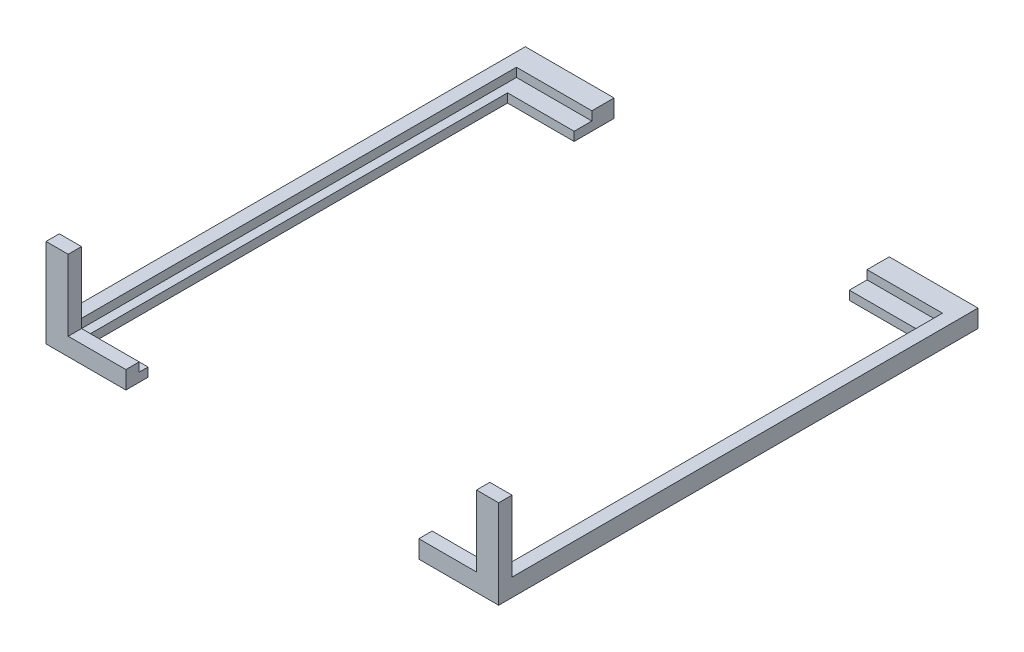
ISO-10303-21;
HEADER;
FILE_DESCRIPTION(('STEP AP214'),'2;1');
FILE_NAME('part.step','',(''),(''),'','','');
FILE_SCHEMA(('AUTOMOTIVE_DESIGN { 1 0 10303 214 1 1 1 1 }'));
ENDSEC;
DATA;
#1=APPLICATION_CONTEXT('core data for automotive mechanical design processes');
#2=APPLICATION_PROTOCOL_DEFINITION('international standard','automotive_design',2000,#1);
#3=PRODUCT_CONTEXT('',#1,'mechanical');
#4=PRODUCT('Part','Part','',(#3));
#5=PRODUCT_RELATED_PRODUCT_CATEGORY('part','',(#4));
#6=PRODUCT_DEFINITION_FORMATION('','',#4);
#7=PRODUCT_DEFINITION_CONTEXT('part definition',#1,'design');
#8=PRODUCT_DEFINITION('design','',#6,#7);
#9=PRODUCT_DEFINITION_SHAPE('','',#8);
#10=(LENGTH_UNIT() NAMED_UNIT(*) SI_UNIT(.MILLI.,.METRE.));
#11=(NAMED_UNIT(*) PLANE_ANGLE_UNIT() SI_UNIT($,.RADIAN.));
#12=(NAMED_UNIT(*) SI_UNIT($,.STERADIAN.) SOLID_ANGLE_UNIT());
#13=UNCERTAINTY_MEASURE_WITH_UNIT(LENGTH_MEASURE(1.E-05),#10,'distance_accuracy_value','');
#14=(GEOMETRIC_REPRESENTATION_CONTEXT(3) GLOBAL_UNCERTAINTY_ASSIGNED_CONTEXT((#13)) GLOBAL_UNIT_ASSIGNED_CONTEXT((#10,
#11,#12)) REPRESENTATION_CONTEXT('',''));
#15=CARTESIAN_POINT('',(0.,0.,0.));
#16=DIRECTION('',(0.,0.,1.));
#17=DIRECTION('',(1.,0.,0.));
#18=AXIS2_PLACEMENT_3D('',#15,#16,#17);
#19=CARTESIAN_POINT('',(23.,0.,24.5));
#20=DIRECTION('',(0.,0.,1.));
#21=DIRECTION('',(1.,0.,0.));
#22=AXIS2_PLACEMENT_3D('',#19,#20,#21);
#23=PLANE('',#22);
#24=DIRECTION('',(-1.,0.,0.));
#25=VECTOR('',#24,1.);
#26=CARTESIAN_POINT('',(23.,1.,24.5));
#27=LINE('',#26,#25);
#28=CARTESIAN_POINT('',(-16.5,1.,24.5));
#29=VERTEX_POINT('',#28);
#30=CARTESIAN_POINT('',(-23.,1.,24.5));
#31=VERTEX_POINT('',#30);
#32=EDGE_CURVE('E251',#29,#31,#27,.T.);
#33=ORIENTED_EDGE('',*,*,#32,.F.);
#34=DIRECTION('',(0.,1.,0.));
#35=VECTOR('',#34,1.);
#36=CARTESIAN_POINT('',(-16.5,0.,24.5));
#37=LINE('',#36,#35);
#38=CARTESIAN_POINT('',(-16.5,0.,24.5));
#39=VERTEX_POINT('',#38);
#40=EDGE_CURVE('E80',#39,#29,#37,.T.);
#41=ORIENTED_EDGE('',*,*,#40,.F.);
#42=DIRECTION('',(1.,0.,0.));
#43=VECTOR('',#42,1.);
#44=CARTESIAN_POINT('',(23.,0.,24.5));
#45=LINE('',#44,#43);
#46=CARTESIAN_POINT('',(-23.,0.,24.5));
#47=VERTEX_POINT('',#46);
#48=EDGE_CURVE('E250',#47,#39,#45,.T.);
#49=ORIENTED_EDGE('',*,*,#48,.F.);
#50=DIRECTION('',(0.,1.,0.));
#51=VECTOR('',#50,1.);
#52=CARTESIAN_POINT('',(-23.,0.,24.5));
#53=LINE('',#52,#51);
#54=EDGE_CURVE('E267',#47,#31,#53,.T.);
#55=ORIENTED_EDGE('',*,*,#54,.T.);
#56=EDGE_LOOP('',(#33,#41,#49,#55));
#57=FACE_BOUND('',#56,.T.);
#58=ADVANCED_FACE('F51',(#57),#23,.F.);
#59=CARTESIAN_POINT('',(25.5,10.,27.));
#60=DIRECTION('',(0.,0.,-1.));
#61=DIRECTION('',(-1.,0.,0.));
#62=AXIS2_PLACEMENT_3D('',#59,#60,#61);
#63=PLANE('',#62);
#64=DIRECTION('',(1.,0.,0.));
#65=VECTOR('',#64,1.);
#66=CARTESIAN_POINT('',(25.5,0.,27.));
#67=LINE('',#66,#65);
#68=CARTESIAN_POINT('',(-25.5,0.,27.));
#69=VERTEX_POINT('',#68);
#70=CARTESIAN_POINT('',(-16.5,0.,27.));
#71=VERTEX_POINT('',#70);
#72=EDGE_CURVE('E243',#69,#71,#67,.T.);
#73=ORIENTED_EDGE('',*,*,#72,.T.);
#74=DIRECTION('',(0.,1.,0.));
#75=VECTOR('',#74,1.);
#76=CARTESIAN_POINT('',(-16.5,10.,27.));
#77=LINE('',#76,#75);
#78=CARTESIAN_POINT('',(-16.5,2.,27.));
#79=VERTEX_POINT('',#78);
#80=EDGE_CURVE('E69',#71,#79,#77,.T.);
#81=ORIENTED_EDGE('',*,*,#80,.T.);
#82=DIRECTION('',(1.,0.,0.));
#83=VECTOR('',#82,1.);
#84=CARTESIAN_POINT('',(23.,2.,27.));
#85=LINE('',#84,#83);
#86=CARTESIAN_POINT('',(-23.,2.,27.));
#87=VERTEX_POINT('',#86);
#88=EDGE_CURVE('E54',#87,#79,#85,.T.);
#89=ORIENTED_EDGE('',*,*,#88,.F.);
#90=DIRECTION('',(0.,1.,0.));
#91=VECTOR('',#90,1.);
#92=CARTESIAN_POINT('',(-23.,2.,27.));
#93=LINE('',#92,#91);
#94=CARTESIAN_POINT('',(-23.,10.,27.));
#95=VERTEX_POINT('',#94);
#96=EDGE_CURVE('E229',#87,#95,#93,.T.);
#97=ORIENTED_EDGE('',*,*,#96,.T.);
#98=DIRECTION('',(1.,0.,0.));
#99=VECTOR('',#98,1.);
#100=CARTESIAN_POINT('',(25.5,10.,27.));
#101=LINE('',#100,#99);
#102=CARTESIAN_POINT('',(-25.5,10.,27.));
#103=VERTEX_POINT('',#102);
#104=EDGE_CURVE('E256',#103,#95,#101,.T.);
#105=ORIENTED_EDGE('',*,*,#104,.F.);
#106=DIRECTION('',(0.,-1.,0.));
#107=VECTOR('',#106,1.);
#108=CARTESIAN_POINT('',(-25.5,10.,27.));
#109=LINE('',#108,#107);
#110=EDGE_CURVE('E233',#103,#69,#109,.T.);
#111=ORIENTED_EDGE('',*,*,#110,.T.);
#112=EDGE_LOOP('',(#73,#81,#89,#97,#105,#111));
#113=FACE_BOUND('',#112,.T.);
#114=ADVANCED_FACE('F348',(#113),#63,.F.);
#115=CARTESIAN_POINT('',(0.,0.,0.));
#116=DIRECTION('',(0.,1.,0.));
#117=DIRECTION('',(0.,0.,1.));
#118=AXIS2_PLACEMENT_3D('',#115,#116,#117);
#119=PLANE('',#118);
#120=ORIENTED_EDGE('',*,*,#48,.T.);
#121=DIRECTION('',(0.,0.,1.));
#122=VECTOR('',#121,1.);
#123=CARTESIAN_POINT('',(-16.5,0.,29.5));
#124=LINE('',#123,#122);
#125=EDGE_CURVE('E83',#39,#71,#124,.T.);
#126=ORIENTED_EDGE('',*,*,#125,.T.);
#127=ORIENTED_EDGE('',*,*,#72,.F.);
#128=DIRECTION('',(0.,0.,1.));
#129=VECTOR('',#128,1.);
#130=CARTESIAN_POINT('',(-25.5,0.,27.));
#131=LINE('',#130,#129);
#132=CARTESIAN_POINT('',(-25.5,0.,-27.));
#133=VERTEX_POINT('',#132);
#134=EDGE_CURVE('E224',#133,#69,#131,.T.);
#135=ORIENTED_EDGE('',*,*,#134,.F.);
#136=DIRECTION('',(-1.,0.,0.));
#137=VECTOR('',#136,1.);
#138=CARTESIAN_POINT('',(25.5,0.,-27.));
#139=LINE('',#138,#137);
#140=CARTESIAN_POINT('',(-15.5,0.,-27.));
#141=VERTEX_POINT('',#140);
#142=EDGE_CURVE('E200',#141,#133,#139,.T.);
#143=ORIENTED_EDGE('',*,*,#142,.F.);
#144=DIRECTION('',(0.,0.,1.));
#145=VECTOR('',#144,1.);
#146=CARTESIAN_POINT('',(-15.5,0.,-22.5));
#147=LINE('',#146,#145);
#148=CARTESIAN_POINT('',(-15.5,0.,-22.5));
#149=VERTEX_POINT('',#148);
#150=EDGE_CURVE('E216',#141,#149,#147,.T.);
#151=ORIENTED_EDGE('',*,*,#150,.T.);
#152=DIRECTION('',(-1.,0.,0.));
#153=VECTOR('',#152,1.);
#154=CARTESIAN_POINT('',(23.,0.,-22.5));
#155=LINE('',#154,#153);
#156=CARTESIAN_POINT('',(-23.,0.,-22.5));
#157=VERTEX_POINT('',#156);
#158=EDGE_CURVE('E220',#149,#157,#155,.T.);
#159=ORIENTED_EDGE('',*,*,#158,.T.);
#160=DIRECTION('',(0.,0.,1.));
#161=VECTOR('',#160,1.);
#162=CARTESIAN_POINT('',(-23.,0.,24.5));
#163=LINE('',#162,#161);
#164=EDGE_CURVE('E255',#157,#47,#163,.T.);
#165=ORIENTED_EDGE('',*,*,#164,.T.);
#166=EDGE_LOOP('',(#120,#126,#127,#135,#143,#151,#159,#165));
#167=FACE_BOUND('',#166,.T.);
#168=ADVANCED_FACE('F319',(#167),#119,.F.);
#169=CARTESIAN_POINT('',(0.,1.,0.));
#170=DIRECTION('',(0.,1.,0.));
#171=DIRECTION('',(0.,0.,1.));
#172=AXIS2_PLACEMENT_3D('',#169,#170,#171);
#173=PLANE('',#172);
#174=DIRECTION('',(0.,0.,1.));
#175=VECTOR('',#174,1.);
#176=CARTESIAN_POINT('',(-16.5,1.,0.));
#177=LINE('',#176,#175);
#178=CARTESIAN_POINT('',(-16.5,1.,25.5));
#179=VERTEX_POINT('',#178);
#180=EDGE_CURVE('E61',#29,#179,#177,.T.);
#181=ORIENTED_EDGE('',*,*,#180,.F.);
#182=ORIENTED_EDGE('',*,*,#32,.T.);
#183=DIRECTION('',(0.,0.,-1.));
#184=VECTOR('',#183,1.);
#185=CARTESIAN_POINT('',(-23.,1.,24.5));
#186=LINE('',#185,#184);
#187=CARTESIAN_POINT('',(-23.,1.,-22.5));
#188=VERTEX_POINT('',#187);
#189=EDGE_CURVE('E195',#31,#188,#186,.T.);
#190=ORIENTED_EDGE('',*,*,#189,.T.);
#191=DIRECTION('',(1.,0.,0.));
#192=VECTOR('',#191,1.);
#193=CARTESIAN_POINT('',(23.,1.,-22.5));
#194=LINE('',#193,#192);
#195=CARTESIAN_POINT('',(-15.5,1.,-22.5));
#196=VERTEX_POINT('',#195);
#197=EDGE_CURVE('E274',#188,#196,#194,.T.);
#198=ORIENTED_EDGE('',*,*,#197,.T.);
#199=DIRECTION('',(0.,0.,1.));
#200=VECTOR('',#199,1.);
#201=CARTESIAN_POINT('',(-15.5,1.,0.));
#202=LINE('',#201,#200);
#203=CARTESIAN_POINT('',(-15.5,1.,-24.5));
#204=VERTEX_POINT('',#203);
#205=EDGE_CURVE('E204',#204,#196,#202,.T.);
#206=ORIENTED_EDGE('',*,*,#205,.F.);
#207=DIRECTION('',(-1.,0.,0.));
#208=VECTOR('',#207,1.);
#209=CARTESIAN_POINT('',(24.,1.,-24.5));
#210=LINE('',#209,#208);
#211=CARTESIAN_POINT('',(-24.,1.,-24.5));
#212=VERTEX_POINT('',#211);
#213=EDGE_CURVE('E127',#204,#212,#210,.T.);
#214=ORIENTED_EDGE('',*,*,#213,.T.);
#215=DIRECTION('',(0.,0.,1.));
#216=VECTOR('',#215,1.);
#217=CARTESIAN_POINT('',(-24.,1.,25.5));
#218=LINE('',#217,#216);
#219=CARTESIAN_POINT('',(-24.,1.,25.5));
#220=VERTEX_POINT('',#219);
#221=EDGE_CURVE('E201',#212,#220,#218,.T.);
#222=ORIENTED_EDGE('',*,*,#221,.T.);
#223=DIRECTION('',(1.,0.,0.));
#224=VECTOR('',#223,1.);
#225=CARTESIAN_POINT('',(24.,1.,25.5));
#226=LINE('',#225,#224);
#227=EDGE_CURVE('E183',#220,#179,#226,.T.);
#228=ORIENTED_EDGE('',*,*,#227,.T.);
#229=EDGE_LOOP('',(#181,#182,#190,#198,#206,#214,#222,#228));
#230=FACE_BOUND('',#229,.T.);
#231=ADVANCED_FACE('F363',(#230),#173,.T.);
#232=CARTESIAN_POINT('',(24.,1.,25.5));
#233=DIRECTION('',(0.,0.,1.));
#234=DIRECTION('',(1.,0.,0.));
#235=AXIS2_PLACEMENT_3D('',#232,#233,#234);
#236=PLANE('',#235);
#237=DIRECTION('',(-1.,0.,0.));
#238=VECTOR('',#237,1.);
#239=CARTESIAN_POINT('',(23.,2.,25.5));
#240=LINE('',#239,#238);
#241=CARTESIAN_POINT('',(-16.5,2.,25.5));
#242=VERTEX_POINT('',#241);
#243=CARTESIAN_POINT('',(-23.,2.,25.5));
#244=VERTEX_POINT('',#243);
#245=EDGE_CURVE('E108',#242,#244,#240,.T.);
#246=ORIENTED_EDGE('',*,*,#245,.F.);
#247=DIRECTION('',(0.,-1.,0.));
#248=VECTOR('',#247,1.);
#249=CARTESIAN_POINT('',(-16.5,1.,25.5));
#250=LINE('',#249,#248);
#251=EDGE_CURVE('E186',#242,#179,#250,.T.);
#252=ORIENTED_EDGE('',*,*,#251,.T.);
#253=ORIENTED_EDGE('',*,*,#227,.F.);
#254=DIRECTION('',(0.,1.,0.));
#255=VECTOR('',#254,1.);
#256=CARTESIAN_POINT('',(-24.,1.,25.5));
#257=LINE('',#256,#255);
#258=CARTESIAN_POINT('',(-24.,2.,25.5));
#259=VERTEX_POINT('',#258);
#260=EDGE_CURVE('E174',#220,#259,#257,.T.);
#261=ORIENTED_EDGE('',*,*,#260,.T.);
#262=DIRECTION('',(1.,0.,0.));
#263=VECTOR('',#262,1.);
#264=CARTESIAN_POINT('',(-25.5,2.,25.5));
#265=LINE('',#264,#263);
#266=CARTESIAN_POINT('',(-25.5,2.,25.5));
#267=VERTEX_POINT('',#266);
#268=EDGE_CURVE('E118',#267,#259,#265,.T.);
#269=ORIENTED_EDGE('',*,*,#268,.F.);
#270=DIRECTION('',(0.,1.,0.));
#271=VECTOR('',#270,1.);
#272=CARTESIAN_POINT('',(-25.5,2.,25.5));
#273=LINE('',#272,#271);
#274=CARTESIAN_POINT('',(-25.5,10.,25.5));
#275=VERTEX_POINT('',#274);
#276=EDGE_CURVE('E185',#267,#275,#273,.T.);
#277=ORIENTED_EDGE('',*,*,#276,.T.);
#278=DIRECTION('',(1.,0.,0.));
#279=VECTOR('',#278,1.);
#280=CARTESIAN_POINT('',(24.,10.,25.5));
#281=LINE('',#280,#279);
#282=CARTESIAN_POINT('',(-23.,10.,25.5));
#283=VERTEX_POINT('',#282);
#284=EDGE_CURVE('E190',#275,#283,#281,.T.);
#285=ORIENTED_EDGE('',*,*,#284,.T.);
#286=DIRECTION('',(0.,1.,0.));
#287=VECTOR('',#286,1.);
#288=CARTESIAN_POINT('',(-23.,2.,25.5));
#289=LINE('',#288,#287);
#290=EDGE_CURVE('E91',#244,#283,#289,.T.);
#291=ORIENTED_EDGE('',*,*,#290,.F.);
#292=EDGE_LOOP('',(#246,#252,#253,#261,#269,#277,#285,#291));
#293=FACE_BOUND('',#292,.T.);
#294=ADVANCED_FACE('F180',(#293),#236,.F.);
#295=CARTESIAN_POINT('',(0.,2.,0.));
#296=DIRECTION('',(0.,1.,0.));
#297=DIRECTION('',(0.,0.,1.));
#298=AXIS2_PLACEMENT_3D('',#295,#296,#297);
#299=PLANE('',#298);
#300=DIRECTION('',(0.,0.,1.));
#301=VECTOR('',#300,1.);
#302=CARTESIAN_POINT('',(-16.5,2.,0.));
#303=LINE('',#302,#301);
#304=EDGE_CURVE('E13',#242,#79,#303,.T.);
#305=ORIENTED_EDGE('',*,*,#304,.F.);
#306=ORIENTED_EDGE('',*,*,#245,.T.);
#307=DIRECTION('',(0.,0.,1.));
#308=VECTOR('',#307,1.);
#309=CARTESIAN_POINT('',(-23.,2.,27.));
#310=LINE('',#309,#308);
#311=EDGE_CURVE('E238',#244,#87,#310,.T.);
#312=ORIENTED_EDGE('',*,*,#311,.T.);
#313=ORIENTED_EDGE('',*,*,#88,.T.);
#314=EDGE_LOOP('',(#305,#306,#312,#313));
#315=FACE_BOUND('',#314,.T.);
#316=ADVANCED_FACE('F340',(#315),#299,.T.);
#317=CARTESIAN_POINT('',(0.,10.,0.));
#318=DIRECTION('',(0.,1.,0.));
#319=DIRECTION('',(0.,0.,1.));
#320=AXIS2_PLACEMENT_3D('',#317,#318,#319);
#321=PLANE('',#320);
#322=DIRECTION('',(0.,0.,1.));
#323=VECTOR('',#322,1.);
#324=CARTESIAN_POINT('',(-23.,10.,27.));
#325=LINE('',#324,#323);
#326=EDGE_CURVE('E178',#283,#95,#325,.T.);
#327=ORIENTED_EDGE('',*,*,#326,.F.);
#328=ORIENTED_EDGE('',*,*,#284,.F.);
#329=DIRECTION('',(0.,0.,1.));
#330=VECTOR('',#329,1.);
#331=CARTESIAN_POINT('',(-25.5,10.,27.));
#332=LINE('',#331,#330);
#333=EDGE_CURVE('E260',#275,#103,#332,.T.);
#334=ORIENTED_EDGE('',*,*,#333,.T.);
#335=ORIENTED_EDGE('',*,*,#104,.T.);
#336=EDGE_LOOP('',(#327,#328,#334,#335));
#337=FACE_BOUND('',#336,.T.);
#338=ADVANCED_FACE('F344',(#337),#321,.T.);
#339=CARTESIAN_POINT('',(25.5,10.,-27.));
#340=DIRECTION('',(0.,0.,1.));
#341=DIRECTION('',(1.,0.,0.));
#342=AXIS2_PLACEMENT_3D('',#339,#340,#341);
#343=PLANE('',#342);
#344=DIRECTION('',(0.,-1.,0.));
#345=VECTOR('',#344,1.);
#346=CARTESIAN_POINT('',(-25.5,10.,-27.));
#347=LINE('',#346,#345);
#348=CARTESIAN_POINT('',(-25.5,2.,-27.));
#349=VERTEX_POINT('',#348);
#350=EDGE_CURVE('E298',#349,#133,#347,.T.);
#351=ORIENTED_EDGE('',*,*,#350,.F.);
#352=DIRECTION('',(-1.,0.,0.));
#353=VECTOR('',#352,1.);
#354=CARTESIAN_POINT('',(24.,2.,-27.));
#355=LINE('',#354,#353);
#356=CARTESIAN_POINT('',(-15.5,2.,-27.));
#357=VERTEX_POINT('',#356);
#358=EDGE_CURVE('E228',#357,#349,#355,.T.);
#359=ORIENTED_EDGE('',*,*,#358,.F.);
#360=DIRECTION('',(0.,1.,0.));
#361=VECTOR('',#360,1.);
#362=CARTESIAN_POINT('',(-15.5,0.,-27.));
#363=LINE('',#362,#361);
#364=EDGE_CURVE('E207',#141,#357,#363,.T.);
#365=ORIENTED_EDGE('',*,*,#364,.F.);
#366=ORIENTED_EDGE('',*,*,#142,.T.);
#367=EDGE_LOOP('',(#351,#359,#365,#366));
#368=FACE_BOUND('',#367,.T.);
#369=ADVANCED_FACE('F357',(#368),#343,.F.);
#370=CARTESIAN_POINT('',(-24.,1.,25.5));
#371=DIRECTION('',(-1.,0.,0.));
#372=DIRECTION('',(0.,0.,1.));
#373=AXIS2_PLACEMENT_3D('',#370,#371,#372);
#374=PLANE('',#373);
#375=DIRECTION('',(0.,0.,-1.));
#376=VECTOR('',#375,1.);
#377=CARTESIAN_POINT('',(-24.,2.,-27.));
#378=LINE('',#377,#376);
#379=CARTESIAN_POINT('',(-24.,2.,-24.5));
#380=VERTEX_POINT('',#379);
#381=EDGE_CURVE('E163',#259,#380,#378,.T.);
#382=ORIENTED_EDGE('',*,*,#381,.F.);
#383=ORIENTED_EDGE('',*,*,#260,.F.);
#384=ORIENTED_EDGE('',*,*,#221,.F.);
#385=DIRECTION('',(0.,1.,0.));
#386=VECTOR('',#385,1.);
#387=CARTESIAN_POINT('',(-24.,1.,-24.5));
#388=LINE('',#387,#386);
#389=EDGE_CURVE('E176',#212,#380,#388,.T.);
#390=ORIENTED_EDGE('',*,*,#389,.T.);
#391=EDGE_LOOP('',(#382,#383,#384,#390));
#392=FACE_BOUND('',#391,.T.);
#393=ADVANCED_FACE('F172',(#392),#374,.F.);
#394=CARTESIAN_POINT('',(24.,1.,-24.5));
#395=DIRECTION('',(0.,0.,-1.));
#396=DIRECTION('',(-1.,0.,0.));
#397=AXIS2_PLACEMENT_3D('',#394,#395,#396);
#398=PLANE('',#397);
#399=DIRECTION('',(1.,0.,0.));
#400=VECTOR('',#399,1.);
#401=CARTESIAN_POINT('',(24.,2.,-24.5));
#402=LINE('',#401,#400);
#403=CARTESIAN_POINT('',(-15.5,2.,-24.5));
#404=VERTEX_POINT('',#403);
#405=EDGE_CURVE('E221',#380,#404,#402,.T.);
#406=ORIENTED_EDGE('',*,*,#405,.F.);
#407=ORIENTED_EDGE('',*,*,#389,.F.);
#408=ORIENTED_EDGE('',*,*,#213,.F.);
#409=DIRECTION('',(0.,1.,0.));
#410=VECTOR('',#409,1.);
#411=CARTESIAN_POINT('',(-15.5,1.,-24.5));
#412=LINE('',#411,#410);
#413=EDGE_CURVE('E199',#204,#404,#412,.T.);
#414=ORIENTED_EDGE('',*,*,#413,.T.);
#415=EDGE_LOOP('',(#406,#407,#408,#414));
#416=FACE_BOUND('',#415,.T.);
#417=ADVANCED_FACE('F386',(#416),#398,.F.);
#418=CARTESIAN_POINT('',(-15.5,0.,-22.5));
#419=DIRECTION('',(-1.,0.,0.));
#420=DIRECTION('',(0.,0.,1.));
#421=AXIS2_PLACEMENT_3D('',#418,#419,#420);
#422=PLANE('',#421);
#423=DIRECTION('',(0.,0.,-1.));
#424=VECTOR('',#423,1.);
#425=CARTESIAN_POINT('',(-15.5,2.,-22.5));
#426=LINE('',#425,#424);
#427=EDGE_CURVE('E223',#404,#357,#426,.T.);
#428=ORIENTED_EDGE('',*,*,#427,.F.);
#429=ORIENTED_EDGE('',*,*,#413,.F.);
#430=ORIENTED_EDGE('',*,*,#205,.T.);
#431=DIRECTION('',(0.,1.,0.));
#432=VECTOR('',#431,1.);
#433=CARTESIAN_POINT('',(-15.5,0.,-22.5));
#434=LINE('',#433,#432);
#435=EDGE_CURVE('E208',#149,#196,#434,.T.);
#436=ORIENTED_EDGE('',*,*,#435,.F.);
#437=ORIENTED_EDGE('',*,*,#150,.F.);
#438=ORIENTED_EDGE('',*,*,#364,.T.);
#439=EDGE_LOOP('',(#428,#429,#430,#436,#437,#438));
#440=FACE_BOUND('',#439,.T.);
#441=ADVANCED_FACE('F359',(#440),#422,.F.);
#442=CARTESIAN_POINT('',(23.,0.,-22.5));
#443=DIRECTION('',(0.,0.,-1.));
#444=DIRECTION('',(-1.,0.,0.));
#445=AXIS2_PLACEMENT_3D('',#442,#443,#444);
#446=PLANE('',#445);
#447=ORIENTED_EDGE('',*,*,#158,.F.);
#448=ORIENTED_EDGE('',*,*,#435,.T.);
#449=ORIENTED_EDGE('',*,*,#197,.F.);
#450=DIRECTION('',(0.,1.,0.));
#451=VECTOR('',#450,1.);
#452=CARTESIAN_POINT('',(-23.,0.,-22.5));
#453=LINE('',#452,#451);
#454=EDGE_CURVE('E212',#157,#188,#453,.T.);
#455=ORIENTED_EDGE('',*,*,#454,.F.);
#456=EDGE_LOOP('',(#447,#448,#449,#455));
#457=FACE_BOUND('',#456,.T.);
#458=ADVANCED_FACE('F361',(#457),#446,.F.);
#459=CARTESIAN_POINT('',(-23.,0.,24.5));
#460=DIRECTION('',(-1.,0.,0.));
#461=DIRECTION('',(0.,0.,1.));
#462=AXIS2_PLACEMENT_3D('',#459,#460,#461);
#463=PLANE('',#462);
#464=ORIENTED_EDGE('',*,*,#189,.F.);
#465=ORIENTED_EDGE('',*,*,#54,.F.);
#466=ORIENTED_EDGE('',*,*,#164,.F.);
#467=ORIENTED_EDGE('',*,*,#454,.T.);
#468=EDGE_LOOP('',(#464,#465,#466,#467));
#469=FACE_BOUND('',#468,.T.);
#470=ADVANCED_FACE('F329',(#469),#463,.F.);
#471=CARTESIAN_POINT('',(-25.5,10.,27.));
#472=DIRECTION('',(1.,0.,0.));
#473=DIRECTION('',(0.,0.,-1.));
#474=AXIS2_PLACEMENT_3D('',#471,#472,#473);
#475=PLANE('',#474);
#476=ORIENTED_EDGE('',*,*,#333,.F.);
#477=ORIENTED_EDGE('',*,*,#276,.F.);
#478=DIRECTION('',(0.,0.,1.));
#479=VECTOR('',#478,1.);
#480=CARTESIAN_POINT('',(-25.5,2.,-27.));
#481=LINE('',#480,#479);
#482=EDGE_CURVE('E166',#349,#267,#481,.T.);
#483=ORIENTED_EDGE('',*,*,#482,.F.);
#484=ORIENTED_EDGE('',*,*,#350,.T.);
#485=ORIENTED_EDGE('',*,*,#134,.T.);
#486=ORIENTED_EDGE('',*,*,#110,.F.);
#487=EDGE_LOOP('',(#476,#477,#483,#484,#485,#486));
#488=FACE_BOUND('',#487,.T.);
#489=ADVANCED_FACE('F353',(#488),#475,.F.);
#490=CARTESIAN_POINT('',(0.,2.,0.));
#491=DIRECTION('',(0.,1.,0.));
#492=DIRECTION('',(0.,0.,1.));
#493=AXIS2_PLACEMENT_3D('',#490,#491,#492);
#494=PLANE('',#493);
#495=ORIENTED_EDGE('',*,*,#405,.T.);
#496=ORIENTED_EDGE('',*,*,#427,.T.);
#497=ORIENTED_EDGE('',*,*,#358,.T.);
#498=ORIENTED_EDGE('',*,*,#482,.T.);
#499=ORIENTED_EDGE('',*,*,#268,.T.);
#500=ORIENTED_EDGE('',*,*,#381,.T.);
#501=EDGE_LOOP('',(#495,#496,#497,#498,#499,#500));
#502=FACE_BOUND('',#501,.T.);
#503=ADVANCED_FACE('F162',(#502),#494,.T.);
#504=CARTESIAN_POINT('',(-23.,2.,27.));
#505=DIRECTION('',(-1.,0.,0.));
#506=DIRECTION('',(0.,0.,1.));
#507=AXIS2_PLACEMENT_3D('',#504,#505,#506);
#508=PLANE('',#507);
#509=ORIENTED_EDGE('',*,*,#326,.T.);
#510=ORIENTED_EDGE('',*,*,#96,.F.);
#511=ORIENTED_EDGE('',*,*,#311,.F.);
#512=ORIENTED_EDGE('',*,*,#290,.T.);
#513=EDGE_LOOP('',(#509,#510,#511,#512));
#514=FACE_BOUND('',#513,.T.);
#515=ADVANCED_FACE('F346',(#514),#508,.F.);
#516=CARTESIAN_POINT('',(-16.5,0.,29.5));
#517=DIRECTION('',(-1.,0.,0.));
#518=DIRECTION('',(0.,0.,1.));
#519=AXIS2_PLACEMENT_3D('',#516,#517,#518);
#520=PLANE('',#519);
#521=ORIENTED_EDGE('',*,*,#125,.F.);
#522=ORIENTED_EDGE('',*,*,#40,.T.);
#523=ORIENTED_EDGE('',*,*,#180,.T.);
#524=ORIENTED_EDGE('',*,*,#251,.F.);
#525=ORIENTED_EDGE('',*,*,#304,.T.);
#526=ORIENTED_EDGE('',*,*,#80,.F.);
#527=EDGE_LOOP('',(#521,#522,#523,#524,#525,#526));
#528=FACE_BOUND('',#527,.T.);
#529=ADVANCED_FACE('F339',(#528),#520,.F.);
#530=CLOSED_SHELL('',(#58,#114,#168,#231,#294,#316,#338,#369,#393,#417,#441,#458,#470,#489,#503,
#515,#529));
#531=MANIFOLD_SOLID_BREP('B2',#530);
#532=CARTESIAN_POINT('',(25.5,10.,-27.));
#533=DIRECTION('',(0.,0.,1.));
#534=DIRECTION('',(1.,0.,0.));
#535=AXIS2_PLACEMENT_3D('',#532,#533,#534);
#536=PLANE('',#535);
#537=DIRECTION('',(-1.,0.,0.));
#538=VECTOR('',#537,1.);
#539=CARTESIAN_POINT('',(24.,2.,-27.));
#540=LINE('',#539,#538);
#541=CARTESIAN_POINT('',(25.5,2.,-27.));
#542=VERTEX_POINT('',#541);
#543=CARTESIAN_POINT('',(15.5,2.,-27.));
#544=VERTEX_POINT('',#543);
#545=EDGE_CURVE('E748',#542,#544,#540,.T.);
#546=ORIENTED_EDGE('',*,*,#545,.F.);
#547=DIRECTION('',(0.,-1.,0.));
#548=VECTOR('',#547,1.);
#549=CARTESIAN_POINT('',(25.5,10.,-27.));
#550=LINE('',#549,#548);
#551=CARTESIAN_POINT('',(25.5,0.,-27.));
#552=VERTEX_POINT('',#551);
#553=EDGE_CURVE('E669',#542,#552,#550,.T.);
#554=ORIENTED_EDGE('',*,*,#553,.T.);
#555=DIRECTION('',(-1.,0.,0.));
#556=VECTOR('',#555,1.);
#557=CARTESIAN_POINT('',(25.5,0.,-27.));
#558=LINE('',#557,#556);
#559=CARTESIAN_POINT('',(15.5,0.,-27.));
#560=VERTEX_POINT('',#559);
#561=EDGE_CURVE('E666',#552,#560,#558,.T.);
#562=ORIENTED_EDGE('',*,*,#561,.T.);
#563=DIRECTION('',(0.,1.,0.));
#564=VECTOR('',#563,1.);
#565=CARTESIAN_POINT('',(15.5,0.,-27.));
#566=LINE('',#565,#564);
#567=EDGE_CURVE('E702',#560,#544,#566,.T.);
#568=ORIENTED_EDGE('',*,*,#567,.T.);
#569=EDGE_LOOP('',(#546,#554,#562,#568));
#570=FACE_BOUND('',#569,.T.);
#571=ADVANCED_FACE('F518',(#570),#536,.F.);
#572=CARTESIAN_POINT('',(23.,0.,24.5));
#573=DIRECTION('',(1.,0.,0.));
#574=DIRECTION('',(0.,0.,-1.));
#575=AXIS2_PLACEMENT_3D('',#572,#573,#574);
#576=PLANE('',#575);
#577=DIRECTION('',(0.,0.,1.));
#578=VECTOR('',#577,1.);
#579=CARTESIAN_POINT('',(23.,1.,24.5));
#580=LINE('',#579,#578);
#581=CARTESIAN_POINT('',(23.,1.,-22.5));
#582=VERTEX_POINT('',#581);
#583=CARTESIAN_POINT('',(23.,1.,24.5));
#584=VERTEX_POINT('',#583);
#585=EDGE_CURVE('E653',#582,#584,#580,.T.);
#586=ORIENTED_EDGE('',*,*,#585,.F.);
#587=DIRECTION('',(0.,1.,0.));
#588=VECTOR('',#587,1.);
#589=CARTESIAN_POINT('',(23.,0.,-22.5));
#590=LINE('',#589,#588);
#591=CARTESIAN_POINT('',(23.,0.,-22.5));
#592=VERTEX_POINT('',#591);
#593=EDGE_CURVE('E659',#592,#582,#590,.T.);
#594=ORIENTED_EDGE('',*,*,#593,.F.);
#595=DIRECTION('',(0.,0.,-1.));
#596=VECTOR('',#595,1.);
#597=CARTESIAN_POINT('',(23.,0.,24.5));
#598=LINE('',#597,#596);
#599=CARTESIAN_POINT('',(23.,0.,24.5));
#600=VERTEX_POINT('',#599);
#601=EDGE_CURVE('E648',#600,#592,#598,.T.);
#602=ORIENTED_EDGE('',*,*,#601,.F.);
#603=DIRECTION('',(0.,1.,0.));
#604=VECTOR('',#603,1.);
#605=CARTESIAN_POINT('',(23.,0.,24.5));
#606=LINE('',#605,#604);
#607=EDGE_CURVE('E647',#600,#584,#606,.T.);
#608=ORIENTED_EDGE('',*,*,#607,.T.);
#609=EDGE_LOOP('',(#586,#594,#602,#608));
#610=FACE_BOUND('',#609,.T.);
#611=ADVANCED_FACE('F720',(#610),#576,.F.);
#612=CARTESIAN_POINT('',(23.,0.,-22.5));
#613=DIRECTION('',(0.,0.,-1.));
#614=DIRECTION('',(-1.,0.,0.));
#615=AXIS2_PLACEMENT_3D('',#612,#613,#614);
#616=PLANE('',#615);
#617=DIRECTION('',(1.,0.,0.));
#618=VECTOR('',#617,1.);
#619=CARTESIAN_POINT('',(23.,1.,-22.5));
#620=LINE('',#619,#618);
#621=CARTESIAN_POINT('',(15.5,1.,-22.5));
#622=VERTEX_POINT('',#621);
#623=EDGE_CURVE('E649',#622,#582,#620,.T.);
#624=ORIENTED_EDGE('',*,*,#623,.F.);
#625=DIRECTION('',(0.,1.,0.));
#626=VECTOR('',#625,1.);
#627=CARTESIAN_POINT('',(15.5,0.,-22.5));
#628=LINE('',#627,#626);
#629=CARTESIAN_POINT('',(15.5,0.,-22.5));
#630=VERTEX_POINT('',#629);
#631=EDGE_CURVE('E698',#630,#622,#628,.T.);
#632=ORIENTED_EDGE('',*,*,#631,.F.);
#633=DIRECTION('',(-1.,0.,0.));
#634=VECTOR('',#633,1.);
#635=CARTESIAN_POINT('',(23.,0.,-22.5));
#636=LINE('',#635,#634);
#637=EDGE_CURVE('E651',#592,#630,#636,.T.);
#638=ORIENTED_EDGE('',*,*,#637,.F.);
#639=ORIENTED_EDGE('',*,*,#593,.T.);
#640=EDGE_LOOP('',(#624,#632,#638,#639));
#641=FACE_BOUND('',#640,.T.);
#642=ADVANCED_FACE('F726',(#641),#616,.F.);
#643=CARTESIAN_POINT('',(15.5,0.,-22.5));
#644=DIRECTION('',(1.,0.,0.));
#645=DIRECTION('',(0.,0.,-1.));
#646=AXIS2_PLACEMENT_3D('',#643,#644,#645);
#647=PLANE('',#646);
#648=DIRECTION('',(0.,0.,1.));
#649=VECTOR('',#648,1.);
#650=CARTESIAN_POINT('',(15.5,2.,-22.5));
#651=LINE('',#650,#649);
#652=CARTESIAN_POINT('',(15.5,2.,-24.5));
#653=VERTEX_POINT('',#652);
#654=EDGE_CURVE('E746',#544,#653,#651,.T.);
#655=ORIENTED_EDGE('',*,*,#654,.F.);
#656=ORIENTED_EDGE('',*,*,#567,.F.);
#657=DIRECTION('',(0.,0.,-1.));
#658=VECTOR('',#657,1.);
#659=CARTESIAN_POINT('',(15.5,0.,-22.5));
#660=LINE('',#659,#658);
#661=EDGE_CURVE('E724',#630,#560,#660,.T.);
#662=ORIENTED_EDGE('',*,*,#661,.F.);
#663=ORIENTED_EDGE('',*,*,#631,.T.);
#664=DIRECTION('',(0.,0.,-1.));
#665=VECTOR('',#664,1.);
#666=CARTESIAN_POINT('',(15.5,1.,0.));
#667=LINE('',#666,#665);
#668=CARTESIAN_POINT('',(15.5,1.,-24.5));
#669=VERTEX_POINT('',#668);
#670=EDGE_CURVE('E695',#622,#669,#667,.T.);
#671=ORIENTED_EDGE('',*,*,#670,.T.);
#672=DIRECTION('',(0.,-1.,0.));
#673=VECTOR('',#672,1.);
#674=CARTESIAN_POINT('',(15.5,1.,-24.5));
#675=LINE('',#674,#673);
#676=EDGE_CURVE('E526',#653,#669,#675,.T.);
#677=ORIENTED_EDGE('',*,*,#676,.F.);
#678=EDGE_LOOP('',(#655,#656,#662,#663,#671,#677));
#679=FACE_BOUND('',#678,.T.);
#680=ADVANCED_FACE('F696',(#679),#647,.F.);
#681=CARTESIAN_POINT('',(24.,1.,-24.5));
#682=DIRECTION('',(0.,0.,-1.));
#683=DIRECTION('',(-1.,0.,0.));
#684=AXIS2_PLACEMENT_3D('',#681,#682,#683);
#685=PLANE('',#684);
#686=DIRECTION('',(1.,0.,0.));
#687=VECTOR('',#686,1.);
#688=CARTESIAN_POINT('',(24.,2.,-24.5));
#689=LINE('',#688,#687);
#690=CARTESIAN_POINT('',(24.,2.,-24.5));
#691=VERTEX_POINT('',#690);
#692=EDGE_CURVE('E691',#653,#691,#689,.T.);
#693=ORIENTED_EDGE('',*,*,#692,.F.);
#694=ORIENTED_EDGE('',*,*,#676,.T.);
#695=DIRECTION('',(-1.,0.,0.));
#696=VECTOR('',#695,1.);
#697=CARTESIAN_POINT('',(24.,1.,-24.5));
#698=LINE('',#697,#696);
#699=CARTESIAN_POINT('',(24.,1.,-24.5));
#700=VERTEX_POINT('',#699);
#701=EDGE_CURVE('E689',#700,#669,#698,.T.);
#702=ORIENTED_EDGE('',*,*,#701,.F.);
#703=DIRECTION('',(0.,1.,0.));
#704=VECTOR('',#703,1.);
#705=CARTESIAN_POINT('',(24.,1.,-24.5));
#706=LINE('',#705,#704);
#707=EDGE_CURVE('E711',#700,#691,#706,.T.);
#708=ORIENTED_EDGE('',*,*,#707,.T.);
#709=EDGE_LOOP('',(#693,#694,#702,#708));
#710=FACE_BOUND('',#709,.T.);
#711=ADVANCED_FACE('F686',(#710),#685,.F.);
#712=CARTESIAN_POINT('',(24.,1.,25.5));
#713=DIRECTION('',(1.,0.,0.));
#714=DIRECTION('',(0.,0.,-1.));
#715=AXIS2_PLACEMENT_3D('',#712,#713,#714);
#716=PLANE('',#715);
#717=DIRECTION('',(0.,0.,1.));
#718=VECTOR('',#717,1.);
#719=CARTESIAN_POINT('',(24.,2.,-27.));
#720=LINE('',#719,#718);
#721=CARTESIAN_POINT('',(24.,2.,25.5));
#722=VERTEX_POINT('',#721);
#723=EDGE_CURVE('E741',#691,#722,#720,.T.);
#724=ORIENTED_EDGE('',*,*,#723,.F.);
#725=ORIENTED_EDGE('',*,*,#707,.F.);
#726=DIRECTION('',(0.,0.,-1.));
#727=VECTOR('',#726,1.);
#728=CARTESIAN_POINT('',(24.,1.,25.5));
#729=LINE('',#728,#727);
#730=CARTESIAN_POINT('',(24.,1.,25.5));
#731=VERTEX_POINT('',#730);
#732=EDGE_CURVE('E707',#731,#700,#729,.T.);
#733=ORIENTED_EDGE('',*,*,#732,.F.);
#734=DIRECTION('',(0.,1.,0.));
#735=VECTOR('',#734,1.);
#736=CARTESIAN_POINT('',(24.,1.,25.5));
#737=LINE('',#736,#735);
#738=EDGE_CURVE('E708',#731,#722,#737,.T.);
#739=ORIENTED_EDGE('',*,*,#738,.T.);
#740=EDGE_LOOP('',(#724,#725,#733,#739));
#741=FACE_BOUND('',#740,.T.);
#742=ADVANCED_FACE('F740',(#741),#716,.F.);
#743=CARTESIAN_POINT('',(0.,2.,0.));
#744=DIRECTION('',(0.,1.,0.));
#745=DIRECTION('',(0.,0.,1.));
#746=AXIS2_PLACEMENT_3D('',#743,#744,#745);
#747=PLANE('',#746);
#748=ORIENTED_EDGE('',*,*,#692,.T.);
#749=ORIENTED_EDGE('',*,*,#723,.T.);
#750=DIRECTION('',(1.,0.,0.));
#751=VECTOR('',#750,1.);
#752=CARTESIAN_POINT('',(25.5,2.,25.5));
#753=LINE('',#752,#751);
#754=CARTESIAN_POINT('',(25.5,2.,25.5));
#755=VERTEX_POINT('',#754);
#756=EDGE_CURVE('E738',#722,#755,#753,.T.);
#757=ORIENTED_EDGE('',*,*,#756,.T.);
#758=DIRECTION('',(0.,0.,-1.));
#759=VECTOR('',#758,1.);
#760=CARTESIAN_POINT('',(25.5,2.,-27.));
#761=LINE('',#760,#759);
#762=EDGE_CURVE('E755',#755,#542,#761,.T.);
#763=ORIENTED_EDGE('',*,*,#762,.T.);
#764=ORIENTED_EDGE('',*,*,#545,.T.);
#765=ORIENTED_EDGE('',*,*,#654,.T.);
#766=EDGE_LOOP('',(#748,#749,#757,#763,#764,#765));
#767=FACE_BOUND('',#766,.T.);
#768=ADVANCED_FACE('F745',(#767),#747,.T.);
#769=CARTESIAN_POINT('',(25.5,10.,27.));
#770=DIRECTION('',(-1.,0.,0.));
#771=DIRECTION('',(0.,0.,1.));
#772=AXIS2_PLACEMENT_3D('',#769,#770,#771);
#773=PLANE('',#772);
#774=ORIENTED_EDGE('',*,*,#762,.F.);
#775=DIRECTION('',(0.,1.,0.));
#776=VECTOR('',#775,1.);
#777=CARTESIAN_POINT('',(25.5,2.,25.5));
#778=LINE('',#777,#776);
#779=CARTESIAN_POINT('',(25.5,10.,25.5));
#780=VERTEX_POINT('',#779);
#781=EDGE_CURVE('E752',#755,#780,#778,.T.);
#782=ORIENTED_EDGE('',*,*,#781,.T.);
#783=DIRECTION('',(0.,0.,-1.));
#784=VECTOR('',#783,1.);
#785=CARTESIAN_POINT('',(25.5,10.,27.));
#786=LINE('',#785,#784);
#787=CARTESIAN_POINT('',(25.5,10.,27.));
#788=VERTEX_POINT('',#787);
#789=EDGE_CURVE('E665',#788,#780,#786,.T.);
#790=ORIENTED_EDGE('',*,*,#789,.F.);
#791=DIRECTION('',(0.,-1.,0.));
#792=VECTOR('',#791,1.);
#793=CARTESIAN_POINT('',(25.5,10.,27.));
#794=LINE('',#793,#792);
#795=CARTESIAN_POINT('',(25.5,0.,27.));
#796=VERTEX_POINT('',#795);
#797=EDGE_CURVE('E677',#788,#796,#794,.T.);
#798=ORIENTED_EDGE('',*,*,#797,.T.);
#799=DIRECTION('',(0.,0.,-1.));
#800=VECTOR('',#799,1.);
#801=CARTESIAN_POINT('',(25.5,0.,27.));
#802=LINE('',#801,#800);
#803=EDGE_CURVE('E671',#796,#552,#802,.T.);
#804=ORIENTED_EDGE('',*,*,#803,.T.);
#805=ORIENTED_EDGE('',*,*,#553,.F.);
#806=EDGE_LOOP('',(#774,#782,#790,#798,#804,#805));
#807=FACE_BOUND('',#806,.T.);
#808=ADVANCED_FACE('F788',(#807),#773,.F.);
#809=CARTESIAN_POINT('',(0.,10.,0.));
#810=DIRECTION('',(0.,1.,0.));
#811=DIRECTION('',(0.,0.,1.));
#812=AXIS2_PLACEMENT_3D('',#809,#810,#811);
#813=PLANE('',#812);
#814=DIRECTION('',(0.,0.,-1.));
#815=VECTOR('',#814,1.);
#816=CARTESIAN_POINT('',(23.,10.,27.));
#817=LINE('',#816,#815);
#818=CARTESIAN_POINT('',(23.,10.,27.));
#819=VERTEX_POINT('',#818);
#820=CARTESIAN_POINT('',(23.,10.,25.5));
#821=VERTEX_POINT('',#820);
#822=EDGE_CURVE('E764',#819,#821,#817,.T.);
#823=ORIENTED_EDGE('',*,*,#822,.F.);
#824=DIRECTION('',(1.,0.,0.));
#825=VECTOR('',#824,1.);
#826=CARTESIAN_POINT('',(25.5,10.,27.));
#827=LINE('',#826,#825);
#828=EDGE_CURVE('E663',#819,#788,#827,.T.);
#829=ORIENTED_EDGE('',*,*,#828,.T.);
#830=ORIENTED_EDGE('',*,*,#789,.T.);
#831=DIRECTION('',(1.,0.,0.));
#832=VECTOR('',#831,1.);
#833=CARTESIAN_POINT('',(24.,10.,25.5));
#834=LINE('',#833,#832);
#835=EDGE_CURVE('E701',#821,#780,#834,.T.);
#836=ORIENTED_EDGE('',*,*,#835,.F.);
#837=EDGE_LOOP('',(#823,#829,#830,#836));
#838=FACE_BOUND('',#837,.T.);
#839=ADVANCED_FACE('F784',(#838),#813,.T.);
#840=CARTESIAN_POINT('',(23.,2.,27.));
#841=DIRECTION('',(1.,0.,0.));
#842=DIRECTION('',(0.,0.,-1.));
#843=AXIS2_PLACEMENT_3D('',#840,#841,#842);
#844=PLANE('',#843);
#845=ORIENTED_EDGE('',*,*,#822,.T.);
#846=DIRECTION('',(0.,1.,0.));
#847=VECTOR('',#846,1.);
#848=CARTESIAN_POINT('',(23.,2.,25.5));
#849=LINE('',#848,#847);
#850=CARTESIAN_POINT('',(23.,2.,25.5));
#851=VERTEX_POINT('',#850);
#852=EDGE_CURVE('E743',#851,#821,#849,.T.);
#853=ORIENTED_EDGE('',*,*,#852,.F.);
#854=DIRECTION('',(0.,0.,-1.));
#855=VECTOR('',#854,1.);
#856=CARTESIAN_POINT('',(23.,2.,27.));
#857=LINE('',#856,#855);
#858=CARTESIAN_POINT('',(23.,2.,27.));
#859=VERTEX_POINT('',#858);
#860=EDGE_CURVE('E540',#859,#851,#857,.T.);
#861=ORIENTED_EDGE('',*,*,#860,.F.);
#862=DIRECTION('',(0.,1.,0.));
#863=VECTOR('',#862,1.);
#864=CARTESIAN_POINT('',(23.,2.,27.));
#865=LINE('',#864,#863);
#866=EDGE_CURVE('E759',#859,#819,#865,.T.);
#867=ORIENTED_EDGE('',*,*,#866,.T.);
#868=EDGE_LOOP('',(#845,#853,#861,#867));
#869=FACE_BOUND('',#868,.T.);
#870=ADVANCED_FACE('F781',(#869),#844,.F.);
#871=CARTESIAN_POINT('',(0.,0.,0.));
#872=DIRECTION('',(0.,1.,0.));
#873=DIRECTION('',(0.,0.,1.));
#874=AXIS2_PLACEMENT_3D('',#871,#872,#873);
#875=PLANE('',#874);
#876=DIRECTION('',(1.,0.,0.));
#877=VECTOR('',#876,1.);
#878=CARTESIAN_POINT('',(25.5,0.,27.));
#879=LINE('',#878,#877);
#880=CARTESIAN_POINT('',(16.5,0.,27.));
#881=VERTEX_POINT('',#880);
#882=EDGE_CURVE('E642',#881,#796,#879,.T.);
#883=ORIENTED_EDGE('',*,*,#882,.F.);
#884=DIRECTION('',(0.,0.,-1.));
#885=VECTOR('',#884,1.);
#886=CARTESIAN_POINT('',(16.5,0.,29.5));
#887=LINE('',#886,#885);
#888=CARTESIAN_POINT('',(16.5,0.,24.5));
#889=VERTEX_POINT('',#888);
#890=EDGE_CURVE('E626',#881,#889,#887,.T.);
#891=ORIENTED_EDGE('',*,*,#890,.T.);
#892=DIRECTION('',(1.,0.,0.));
#893=VECTOR('',#892,1.);
#894=CARTESIAN_POINT('',(23.,0.,24.5));
#895=LINE('',#894,#893);
#896=EDGE_CURVE('E639',#889,#600,#895,.T.);
#897=ORIENTED_EDGE('',*,*,#896,.T.);
#898=ORIENTED_EDGE('',*,*,#601,.T.);
#899=ORIENTED_EDGE('',*,*,#637,.T.);
#900=ORIENTED_EDGE('',*,*,#661,.T.);
#901=ORIENTED_EDGE('',*,*,#561,.F.);
#902=ORIENTED_EDGE('',*,*,#803,.F.);
#903=EDGE_LOOP('',(#883,#891,#897,#898,#899,#900,#901,#902));
#904=FACE_BOUND('',#903,.T.);
#905=ADVANCED_FACE('F637',(#904),#875,.F.);
#906=CARTESIAN_POINT('',(0.,2.,0.));
#907=DIRECTION('',(0.,1.,0.));
#908=DIRECTION('',(0.,0.,1.));
#909=AXIS2_PLACEMENT_3D('',#906,#907,#908);
#910=PLANE('',#909);
#911=DIRECTION('',(0.,0.,-1.));
#912=VECTOR('',#911,1.);
#913=CARTESIAN_POINT('',(16.5,2.,0.));
#914=LINE('',#913,#912);
#915=CARTESIAN_POINT('',(16.5,2.,27.));
#916=VERTEX_POINT('',#915);
#917=CARTESIAN_POINT('',(16.5,2.,25.5));
#918=VERTEX_POINT('',#917);
#919=EDGE_CURVE('E49',#916,#918,#914,.T.);
#920=ORIENTED_EDGE('',*,*,#919,.F.);
#921=DIRECTION('',(1.,0.,0.));
#922=VECTOR('',#921,1.);
#923=CARTESIAN_POINT('',(23.,2.,27.));
#924=LINE('',#923,#922);
#925=EDGE_CURVE('E766',#916,#859,#924,.T.);
#926=ORIENTED_EDGE('',*,*,#925,.T.);
#927=ORIENTED_EDGE('',*,*,#860,.T.);
#928=DIRECTION('',(-1.,0.,0.));
#929=VECTOR('',#928,1.);
#930=CARTESIAN_POINT('',(23.,2.,25.5));
#931=LINE('',#930,#929);
#932=EDGE_CURVE('E761',#851,#918,#931,.T.);
#933=ORIENTED_EDGE('',*,*,#932,.T.);
#934=EDGE_LOOP('',(#920,#926,#927,#933));
#935=FACE_BOUND('',#934,.T.);
#936=ADVANCED_FACE('F773',(#935),#910,.T.);
#937=CARTESIAN_POINT('',(24.,1.,25.5));
#938=DIRECTION('',(0.,0.,1.));
#939=DIRECTION('',(1.,0.,0.));
#940=AXIS2_PLACEMENT_3D('',#937,#938,#939);
#941=PLANE('',#940);
#942=DIRECTION('',(1.,0.,0.));
#943=VECTOR('',#942,1.);
#944=CARTESIAN_POINT('',(24.,1.,25.5));
#945=LINE('',#944,#943);
#946=CARTESIAN_POINT('',(16.5,1.,25.5));
#947=VERTEX_POINT('',#946);
#948=EDGE_CURVE('E713',#947,#731,#945,.T.);
#949=ORIENTED_EDGE('',*,*,#948,.F.);
#950=DIRECTION('',(0.,1.,0.));
#951=VECTOR('',#950,1.);
#952=CARTESIAN_POINT('',(16.5,1.,25.5));
#953=LINE('',#952,#951);
#954=EDGE_CURVE('E633',#947,#918,#953,.T.);
#955=ORIENTED_EDGE('',*,*,#954,.T.);
#956=ORIENTED_EDGE('',*,*,#932,.F.);
#957=ORIENTED_EDGE('',*,*,#852,.T.);
#958=ORIENTED_EDGE('',*,*,#835,.T.);
#959=ORIENTED_EDGE('',*,*,#781,.F.);
#960=ORIENTED_EDGE('',*,*,#756,.F.);
#961=ORIENTED_EDGE('',*,*,#738,.F.);
#962=EDGE_LOOP('',(#949,#955,#956,#957,#958,#959,#960,#961));
#963=FACE_BOUND('',#962,.T.);
#964=ADVANCED_FACE('F736',(#963),#941,.F.);
#965=CARTESIAN_POINT('',(0.,1.,0.));
#966=DIRECTION('',(0.,1.,0.));
#967=DIRECTION('',(0.,0.,1.));
#968=AXIS2_PLACEMENT_3D('',#965,#966,#967);
#969=PLANE('',#968);
#970=DIRECTION('',(0.,0.,-1.));
#971=VECTOR('',#970,1.);
#972=CARTESIAN_POINT('',(16.5,1.,0.));
#973=LINE('',#972,#971);
#974=CARTESIAN_POINT('',(16.5,1.,24.5));
#975=VERTEX_POINT('',#974);
#976=EDGE_CURVE('E628',#947,#975,#973,.T.);
#977=ORIENTED_EDGE('',*,*,#976,.F.);
#978=ORIENTED_EDGE('',*,*,#948,.T.);
#979=ORIENTED_EDGE('',*,*,#732,.T.);
#980=ORIENTED_EDGE('',*,*,#701,.T.);
#981=ORIENTED_EDGE('',*,*,#670,.F.);
#982=ORIENTED_EDGE('',*,*,#623,.T.);
#983=ORIENTED_EDGE('',*,*,#585,.T.);
#984=DIRECTION('',(-1.,0.,0.));
#985=VECTOR('',#984,1.);
#986=CARTESIAN_POINT('',(23.,1.,24.5));
#987=LINE('',#986,#985);
#988=EDGE_CURVE('E680',#584,#975,#987,.T.);
#989=ORIENTED_EDGE('',*,*,#988,.T.);
#990=EDGE_LOOP('',(#977,#978,#979,#980,#981,#982,#983,#989));
#991=FACE_BOUND('',#990,.T.);
#992=ADVANCED_FACE('F705',(#991),#969,.T.);
#993=CARTESIAN_POINT('',(25.5,10.,27.));
#994=DIRECTION('',(0.,0.,-1.));
#995=DIRECTION('',(-1.,0.,0.));
#996=AXIS2_PLACEMENT_3D('',#993,#994,#995);
#997=PLANE('',#996);
#998=ORIENTED_EDGE('',*,*,#925,.F.);
#999=DIRECTION('',(0.,-1.,0.));
#1000=VECTOR('',#999,1.);
#1001=CARTESIAN_POINT('',(16.5,10.,27.));
#1002=LINE('',#1001,#1000);
#1003=EDGE_CURVE('E532',#916,#881,#1002,.T.);
#1004=ORIENTED_EDGE('',*,*,#1003,.T.);
#1005=ORIENTED_EDGE('',*,*,#882,.T.);
#1006=ORIENTED_EDGE('',*,*,#797,.F.);
#1007=ORIENTED_EDGE('',*,*,#828,.F.);
#1008=ORIENTED_EDGE('',*,*,#866,.F.);
#1009=EDGE_LOOP('',(#998,#1004,#1005,#1006,#1007,#1008));
#1010=FACE_BOUND('',#1009,.T.);
#1011=ADVANCED_FACE('F520',(#1010),#997,.F.);
#1012=CARTESIAN_POINT('',(23.,0.,24.5));
#1013=DIRECTION('',(0.,0.,1.));
#1014=DIRECTION('',(1.,0.,0.));
#1015=AXIS2_PLACEMENT_3D('',#1012,#1013,#1014);
#1016=PLANE('',#1015);
#1017=ORIENTED_EDGE('',*,*,#896,.F.);
#1018=DIRECTION('',(0.,1.,0.));
#1019=VECTOR('',#1018,1.);
#1020=CARTESIAN_POINT('',(16.5,0.,24.5));
#1021=LINE('',#1020,#1019);
#1022=EDGE_CURVE('E623',#889,#975,#1021,.T.);
#1023=ORIENTED_EDGE('',*,*,#1022,.T.);
#1024=ORIENTED_EDGE('',*,*,#988,.F.);
#1025=ORIENTED_EDGE('',*,*,#607,.F.);
#1026=EDGE_LOOP('',(#1017,#1023,#1024,#1025));
#1027=FACE_BOUND('',#1026,.T.);
#1028=ADVANCED_FACE('F645',(#1027),#1016,.F.);
#1029=CARTESIAN_POINT('',(16.5,0.,29.5));
#1030=DIRECTION('',(1.,0.,0.));
#1031=DIRECTION('',(0.,0.,-1.));
#1032=AXIS2_PLACEMENT_3D('',#1029,#1030,#1031);
#1033=PLANE('',#1032);
#1034=ORIENTED_EDGE('',*,*,#919,.T.);
#1035=ORIENTED_EDGE('',*,*,#954,.F.);
#1036=ORIENTED_EDGE('',*,*,#976,.T.);
#1037=ORIENTED_EDGE('',*,*,#1022,.F.);
#1038=ORIENTED_EDGE('',*,*,#890,.F.);
#1039=ORIENTED_EDGE('',*,*,#1003,.F.);
#1040=EDGE_LOOP('',(#1034,#1035,#1036,#1037,#1038,#1039));
#1041=FACE_BOUND('',#1040,.T.);
#1042=ADVANCED_FACE('F625',(#1041),#1033,.F.);
#1043=CLOSED_SHELL('',(#571,#611,#642,#680,#711,#742,#768,#808,#839,#870,#905,#936,#964,#992,
#1011,#1028,#1042));
#1044=MANIFOLD_SOLID_BREP('B7',#1043);
#1045=ADVANCED_BREP_SHAPE_REPRESENTATION('',(#18,#531,#1044),#14);
#1046=SHAPE_DEFINITION_REPRESENTATION(#9,#1045);
ENDSEC;
END-ISO-10303-21;
